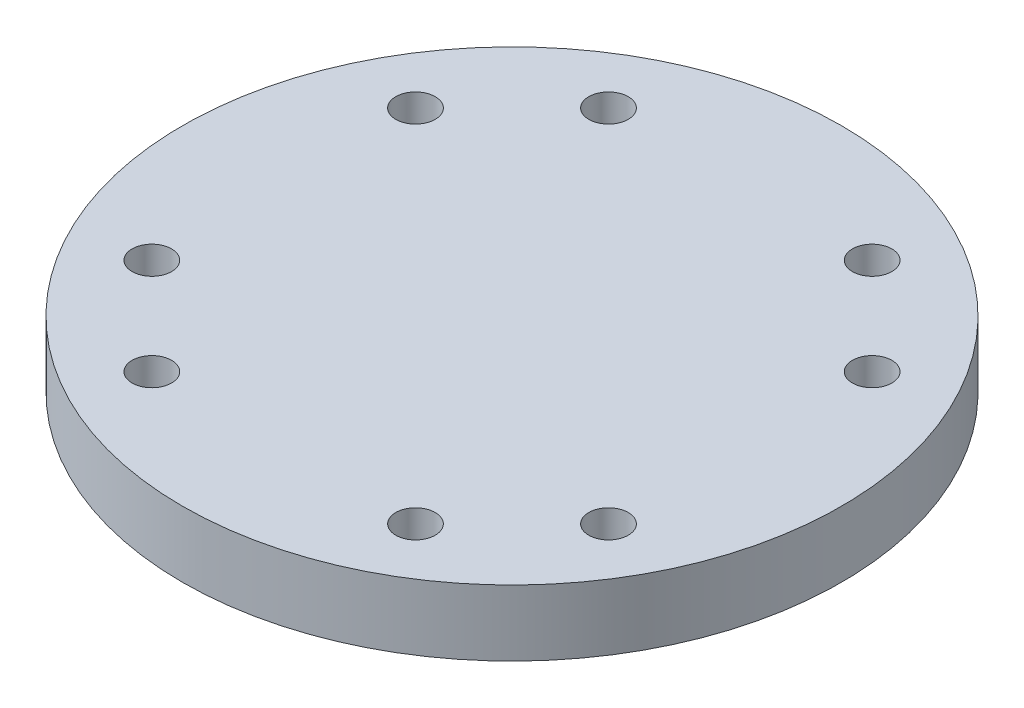
ISO-10303-21;
HEADER;
FILE_DESCRIPTION(('STEP AP214'),'2;1');
FILE_NAME('part.step','',(''),(''),'','','');
FILE_SCHEMA(('AUTOMOTIVE_DESIGN { 1 0 10303 214 1 1 1 1 }'));
ENDSEC;
DATA;
#1=APPLICATION_CONTEXT('core data for automotive mechanical design processes');
#2=APPLICATION_PROTOCOL_DEFINITION('international standard','automotive_design',2000,#1);
#3=PRODUCT_CONTEXT('',#1,'mechanical');
#4=PRODUCT('Part','Part','',(#3));
#5=PRODUCT_RELATED_PRODUCT_CATEGORY('part','',(#4));
#6=PRODUCT_DEFINITION_FORMATION('','',#4);
#7=PRODUCT_DEFINITION_CONTEXT('part definition',#1,'design');
#8=PRODUCT_DEFINITION('design','',#6,#7);
#9=PRODUCT_DEFINITION_SHAPE('','',#8);
#10=(LENGTH_UNIT() NAMED_UNIT(*) SI_UNIT(.MILLI.,.METRE.));
#11=(NAMED_UNIT(*) PLANE_ANGLE_UNIT() SI_UNIT($,.RADIAN.));
#12=(NAMED_UNIT(*) SI_UNIT($,.STERADIAN.) SOLID_ANGLE_UNIT());
#13=UNCERTAINTY_MEASURE_WITH_UNIT(LENGTH_MEASURE(1.E-05),#10,'distance_accuracy_value','');
#14=(GEOMETRIC_REPRESENTATION_CONTEXT(3) GLOBAL_UNCERTAINTY_ASSIGNED_CONTEXT((#13)) GLOBAL_UNIT_ASSIGNED_CONTEXT((#10,
#11,#12)) REPRESENTATION_CONTEXT('',''));
#15=CARTESIAN_POINT('',(0.,0.,0.));
#16=DIRECTION('',(0.,0.,1.));
#17=DIRECTION('',(1.,0.,0.));
#18=AXIS2_PLACEMENT_3D('',#15,#16,#17);
#19=CARTESIAN_POINT('',(0.,3.175,0.));
#20=DIRECTION('',(0.,1.,0.));
#21=DIRECTION('',(0.,0.,1.));
#22=AXIS2_PLACEMENT_3D('',#19,#20,#21);
#23=PLANE('',#22);
#24=CARTESIAN_POINT('',(-12.6999999999996,3.175,-21.9970452561249));
#25=DIRECTION('',(0.,1.,0.));
#26=DIRECTION('',(0.,0.,1.));
#27=AXIS2_PLACEMENT_3D('',#24,#25,#26);
#28=CIRCLE('',#27,1.90000001);
#29=CARTESIAN_POINT('',(-12.6999999999996,3.175,-20.0970452461249));
#30=VERTEX_POINT('',#29);
#31=EDGE_CURVE('E100',#30,#30,#28,.T.);
#32=ORIENTED_EDGE('',*,*,#31,.F.);
#33=EDGE_LOOP('',(#32));
#34=FACE_BOUND('',#33,.T.);
#35=CARTESIAN_POINT('',(-21.9970452561249,3.175,12.6999999999997));
#36=DIRECTION('',(0.,1.,0.));
#37=DIRECTION('',(0.,0.,1.));
#38=AXIS2_PLACEMENT_3D('',#35,#36,#37);
#39=CIRCLE('',#38,1.90000001);
#40=CARTESIAN_POINT('',(-21.9970452561249,3.175,14.6000000099997));
#41=VERTEX_POINT('',#40);
#42=EDGE_CURVE('E84',#41,#41,#39,.T.);
#43=ORIENTED_EDGE('',*,*,#42,.F.);
#44=EDGE_LOOP('',(#43));
#45=FACE_BOUND('',#44,.T.);
#46=CARTESIAN_POINT('',(12.6999999999998,3.175,21.9970452561249));
#47=DIRECTION('',(0.,1.,0.));
#48=DIRECTION('',(0.,0.,1.));
#49=AXIS2_PLACEMENT_3D('',#46,#47,#48);
#50=CIRCLE('',#49,1.90000001);
#51=CARTESIAN_POINT('',(12.6999999999998,3.175,23.8970452661249));
#52=VERTEX_POINT('',#51);
#53=EDGE_CURVE('E68',#52,#52,#50,.T.);
#54=ORIENTED_EDGE('',*,*,#53,.F.);
#55=EDGE_LOOP('',(#54));
#56=FACE_BOUND('',#55,.T.);
#57=CARTESIAN_POINT('',(21.9970452561248,3.175,-12.6999999999999));
#58=DIRECTION('',(0.,1.,0.));
#59=DIRECTION('',(0.,0.,1.));
#60=AXIS2_PLACEMENT_3D('',#57,#58,#59);
#61=CIRCLE('',#60,1.90000001);
#62=CARTESIAN_POINT('',(21.9970452561248,3.175,-10.7999999899999));
#63=VERTEX_POINT('',#62);
#64=EDGE_CURVE('E54',#63,#63,#61,.T.);
#65=ORIENTED_EDGE('',*,*,#64,.F.);
#66=EDGE_LOOP('',(#65));
#67=FACE_BOUND('',#66,.T.);
#68=CARTESIAN_POINT('',(0.,3.175,0.));
#69=DIRECTION('',(0.,1.,0.));
#70=DIRECTION('',(0.,0.,1.));
#71=AXIS2_PLACEMENT_3D('',#68,#69,#70);
#72=CIRCLE('',#71,31.75);
#73=CARTESIAN_POINT('',(0.,3.175,31.75));
#74=VERTEX_POINT('',#73);
#75=EDGE_CURVE('E10',#74,#74,#72,.T.);
#76=ORIENTED_EDGE('',*,*,#75,.T.);
#77=EDGE_LOOP('',(#76));
#78=FACE_BOUND('',#77,.T.);
#79=CARTESIAN_POINT('',(21.9970452561248,3.175,12.6999999999999));
#80=DIRECTION('',(0.,1.,0.));
#81=DIRECTION('',(0.,0.,-1.));
#82=AXIS2_PLACEMENT_3D('',#79,#80,#81);
#83=CIRCLE('',#82,1.90000001);
#84=CARTESIAN_POINT('',(21.9970452561248,3.175,10.7999999899999));
#85=VERTEX_POINT('',#84);
#86=EDGE_CURVE('E60',#85,#85,#83,.T.);
#87=ORIENTED_EDGE('',*,*,#86,.F.);
#88=EDGE_LOOP('',(#87));
#89=FACE_BOUND('',#88,.T.);
#90=CARTESIAN_POINT('',(-12.6999999999999,3.175,21.9970452561248));
#91=DIRECTION('',(0.,1.,0.));
#92=DIRECTION('',(0.,0.,-1.));
#93=AXIS2_PLACEMENT_3D('',#90,#91,#92);
#94=CIRCLE('',#93,1.90000001);
#95=CARTESIAN_POINT('',(-12.6999999999999,3.175,20.0970452461248));
#96=VERTEX_POINT('',#95);
#97=EDGE_CURVE('E76',#96,#96,#94,.T.);
#98=ORIENTED_EDGE('',*,*,#97,.F.);
#99=EDGE_LOOP('',(#98));
#100=FACE_BOUND('',#99,.T.);
#101=CARTESIAN_POINT('',(-21.9970452561247,3.175,-12.7));
#102=DIRECTION('',(0.,1.,0.));
#103=DIRECTION('',(0.,0.,-1.));
#104=AXIS2_PLACEMENT_3D('',#101,#102,#103);
#105=CIRCLE('',#104,1.90000001);
#106=CARTESIAN_POINT('',(-21.9970452561247,3.175,-14.60000001));
#107=VERTEX_POINT('',#106);
#108=EDGE_CURVE('E92',#107,#107,#105,.T.);
#109=ORIENTED_EDGE('',*,*,#108,.F.);
#110=EDGE_LOOP('',(#109));
#111=FACE_BOUND('',#110,.T.);
#112=CARTESIAN_POINT('',(12.7000000000001,3.175,-21.9970452561247));
#113=DIRECTION('',(0.,1.,0.));
#114=DIRECTION('',(0.,0.,-1.));
#115=AXIS2_PLACEMENT_3D('',#112,#113,#114);
#116=CIRCLE('',#115,1.90000001);
#117=CARTESIAN_POINT('',(12.7000000000001,3.175,-23.8970452661247));
#118=VERTEX_POINT('',#117);
#119=EDGE_CURVE('E108',#118,#118,#116,.T.);
#120=ORIENTED_EDGE('',*,*,#119,.F.);
#121=EDGE_LOOP('',(#120));
#122=FACE_BOUND('',#121,.T.);
#123=ADVANCED_FACE('F41',(#34,#45,#56,#67,#78,#89,#100,#111,#122),#23,.T.);
#124=CARTESIAN_POINT('',(0.,-3.175,0.));
#125=DIRECTION('',(0.,1.,0.));
#126=DIRECTION('',(0.,0.,1.));
#127=AXIS2_PLACEMENT_3D('',#124,#125,#126);
#128=PLANE('',#127);
#129=CARTESIAN_POINT('',(0.,-3.175,0.));
#130=DIRECTION('',(0.,1.,0.));
#131=DIRECTION('',(0.,0.,1.));
#132=AXIS2_PLACEMENT_3D('',#129,#130,#131);
#133=CIRCLE('',#132,31.75);
#134=CARTESIAN_POINT('',(0.,-3.175,31.75));
#135=VERTEX_POINT('',#134);
#136=EDGE_CURVE('E45',#135,#135,#133,.T.);
#137=ORIENTED_EDGE('',*,*,#136,.F.);
#138=EDGE_LOOP('',(#137));
#139=FACE_BOUND('',#138,.T.);
#140=CARTESIAN_POINT('',(21.9970452561248,-3.175,-12.6999999999999));
#141=DIRECTION('',(0.,1.,0.));
#142=DIRECTION('',(0.,0.,1.));
#143=AXIS2_PLACEMENT_3D('',#140,#141,#142);
#144=CIRCLE('',#143,1.90000001);
#145=CARTESIAN_POINT('',(21.9970452561248,-3.175,-10.7999999899999));
#146=VERTEX_POINT('',#145);
#147=EDGE_CURVE('E56',#146,#146,#144,.T.);
#148=ORIENTED_EDGE('',*,*,#147,.T.);
#149=EDGE_LOOP('',(#148));
#150=FACE_BOUND('',#149,.T.);
#151=CARTESIAN_POINT('',(21.9970452561248,-3.175,12.6999999999999));
#152=DIRECTION('',(0.,1.,0.));
#153=DIRECTION('',(0.,0.,-1.));
#154=AXIS2_PLACEMENT_3D('',#151,#152,#153);
#155=CIRCLE('',#154,1.90000001);
#156=CARTESIAN_POINT('',(21.9970452561248,-3.175,10.7999999899999));
#157=VERTEX_POINT('',#156);
#158=EDGE_CURVE('E64',#157,#157,#155,.T.);
#159=ORIENTED_EDGE('',*,*,#158,.T.);
#160=EDGE_LOOP('',(#159));
#161=FACE_BOUND('',#160,.T.);
#162=CARTESIAN_POINT('',(12.6999999999998,-3.175,21.9970452561249));
#163=DIRECTION('',(0.,1.,0.));
#164=DIRECTION('',(0.,0.,1.));
#165=AXIS2_PLACEMENT_3D('',#162,#163,#164);
#166=CIRCLE('',#165,1.90000001);
#167=CARTESIAN_POINT('',(12.6999999999998,-3.175,23.8970452661249));
#168=VERTEX_POINT('',#167);
#169=EDGE_CURVE('E72',#168,#168,#166,.T.);
#170=ORIENTED_EDGE('',*,*,#169,.T.);
#171=EDGE_LOOP('',(#170));
#172=FACE_BOUND('',#171,.T.);
#173=CARTESIAN_POINT('',(-12.6999999999999,-3.175,21.9970452561248));
#174=DIRECTION('',(0.,1.,0.));
#175=DIRECTION('',(0.,0.,-1.));
#176=AXIS2_PLACEMENT_3D('',#173,#174,#175);
#177=CIRCLE('',#176,1.90000001);
#178=CARTESIAN_POINT('',(-12.6999999999999,-3.175,20.0970452461248));
#179=VERTEX_POINT('',#178);
#180=EDGE_CURVE('E80',#179,#179,#177,.T.);
#181=ORIENTED_EDGE('',*,*,#180,.T.);
#182=EDGE_LOOP('',(#181));
#183=FACE_BOUND('',#182,.T.);
#184=CARTESIAN_POINT('',(-21.9970452561249,-3.175,12.6999999999997));
#185=DIRECTION('',(0.,1.,0.));
#186=DIRECTION('',(0.,0.,1.));
#187=AXIS2_PLACEMENT_3D('',#184,#185,#186);
#188=CIRCLE('',#187,1.90000001);
#189=CARTESIAN_POINT('',(-21.9970452561249,-3.175,14.6000000099997));
#190=VERTEX_POINT('',#189);
#191=EDGE_CURVE('E88',#190,#190,#188,.T.);
#192=ORIENTED_EDGE('',*,*,#191,.T.);
#193=EDGE_LOOP('',(#192));
#194=FACE_BOUND('',#193,.T.);
#195=CARTESIAN_POINT('',(-21.9970452561247,-3.175,-12.7));
#196=DIRECTION('',(0.,1.,0.));
#197=DIRECTION('',(0.,0.,-1.));
#198=AXIS2_PLACEMENT_3D('',#195,#196,#197);
#199=CIRCLE('',#198,1.90000001);
#200=CARTESIAN_POINT('',(-21.9970452561247,-3.175,-14.60000001));
#201=VERTEX_POINT('',#200);
#202=EDGE_CURVE('E96',#201,#201,#199,.T.);
#203=ORIENTED_EDGE('',*,*,#202,.T.);
#204=EDGE_LOOP('',(#203));
#205=FACE_BOUND('',#204,.T.);
#206=CARTESIAN_POINT('',(-12.6999999999996,-3.175,-21.9970452561249));
#207=DIRECTION('',(0.,1.,0.));
#208=DIRECTION('',(0.,0.,1.));
#209=AXIS2_PLACEMENT_3D('',#206,#207,#208);
#210=CIRCLE('',#209,1.90000001);
#211=CARTESIAN_POINT('',(-12.6999999999996,-3.175,-20.0970452461249));
#212=VERTEX_POINT('',#211);
#213=EDGE_CURVE('E104',#212,#212,#210,.T.);
#214=ORIENTED_EDGE('',*,*,#213,.T.);
#215=EDGE_LOOP('',(#214));
#216=FACE_BOUND('',#215,.T.);
#217=CARTESIAN_POINT('',(12.7000000000001,-3.175,-21.9970452561247));
#218=DIRECTION('',(0.,1.,0.));
#219=DIRECTION('',(0.,0.,-1.));
#220=AXIS2_PLACEMENT_3D('',#217,#218,#219);
#221=CIRCLE('',#220,1.90000001);
#222=CARTESIAN_POINT('',(12.7000000000001,-3.175,-23.8970452661247));
#223=VERTEX_POINT('',#222);
#224=EDGE_CURVE('E112',#223,#223,#221,.T.);
#225=ORIENTED_EDGE('',*,*,#224,.T.);
#226=EDGE_LOOP('',(#225));
#227=FACE_BOUND('',#226,.T.);
#228=ADVANCED_FACE('F124',(#139,#150,#161,#172,#183,#194,#205,#216,#227),#128,.F.);
#229=CARTESIAN_POINT('',(0.,3.175,0.));
#230=DIRECTION('',(0.,-1.,0.));
#231=DIRECTION('',(0.,0.,-1.));
#232=AXIS2_PLACEMENT_3D('',#229,#230,#231);
#233=CYLINDRICAL_SURFACE('',#232,31.75);
#234=ORIENTED_EDGE('',*,*,#75,.F.);
#235=EDGE_LOOP('',(#234));
#236=FACE_BOUND('',#235,.T.);
#237=ORIENTED_EDGE('',*,*,#136,.T.);
#238=EDGE_LOOP('',(#237));
#239=FACE_BOUND('',#238,.T.);
#240=ADVANCED_FACE('F43',(#236,#239),#233,.T.);
#241=CARTESIAN_POINT('',(21.9970452561248,3.175,-12.6999999999999));
#242=DIRECTION('',(0.,-1.,0.));
#243=DIRECTION('',(0.,0.,-1.));
#244=AXIS2_PLACEMENT_3D('',#241,#242,#243);
#245=CYLINDRICAL_SURFACE('',#244,1.90000001);
#246=ORIENTED_EDGE('',*,*,#64,.T.);
#247=EDGE_LOOP('',(#246));
#248=FACE_BOUND('',#247,.T.);
#249=ORIENTED_EDGE('',*,*,#147,.F.);
#250=EDGE_LOOP('',(#249));
#251=FACE_BOUND('',#250,.T.);
#252=ADVANCED_FACE('F134',(#248,#251),#245,.F.);
#253=CARTESIAN_POINT('',(21.9970452561248,3.175,12.6999999999999));
#254=DIRECTION('',(0.,-1.,0.));
#255=DIRECTION('',(0.,0.,-1.));
#256=AXIS2_PLACEMENT_3D('',#253,#254,#255);
#257=CYLINDRICAL_SURFACE('',#256,1.90000001);
#258=ORIENTED_EDGE('',*,*,#86,.T.);
#259=EDGE_LOOP('',(#258));
#260=FACE_BOUND('',#259,.T.);
#261=ORIENTED_EDGE('',*,*,#158,.F.);
#262=EDGE_LOOP('',(#261));
#263=FACE_BOUND('',#262,.T.);
#264=ADVANCED_FACE('F137',(#260,#263),#257,.F.);
#265=CARTESIAN_POINT('',(12.6999999999998,3.175,21.9970452561249));
#266=DIRECTION('',(0.,-1.,0.));
#267=DIRECTION('',(0.,0.,-1.));
#268=AXIS2_PLACEMENT_3D('',#265,#266,#267);
#269=CYLINDRICAL_SURFACE('',#268,1.90000001);
#270=ORIENTED_EDGE('',*,*,#53,.T.);
#271=EDGE_LOOP('',(#270));
#272=FACE_BOUND('',#271,.T.);
#273=ORIENTED_EDGE('',*,*,#169,.F.);
#274=EDGE_LOOP('',(#273));
#275=FACE_BOUND('',#274,.T.);
#276=ADVANCED_FACE('F141',(#272,#275),#269,.F.);
#277=CARTESIAN_POINT('',(-12.6999999999999,3.175,21.9970452561248));
#278=DIRECTION('',(0.,-1.,0.));
#279=DIRECTION('',(0.,0.,-1.));
#280=AXIS2_PLACEMENT_3D('',#277,#278,#279);
#281=CYLINDRICAL_SURFACE('',#280,1.90000001);
#282=ORIENTED_EDGE('',*,*,#97,.T.);
#283=EDGE_LOOP('',(#282));
#284=FACE_BOUND('',#283,.T.);
#285=ORIENTED_EDGE('',*,*,#180,.F.);
#286=EDGE_LOOP('',(#285));
#287=FACE_BOUND('',#286,.T.);
#288=ADVANCED_FACE('F145',(#284,#287),#281,.F.);
#289=CARTESIAN_POINT('',(-21.9970452561249,3.175,12.6999999999997));
#290=DIRECTION('',(0.,-1.,0.));
#291=DIRECTION('',(0.,0.,-1.));
#292=AXIS2_PLACEMENT_3D('',#289,#290,#291);
#293=CYLINDRICAL_SURFACE('',#292,1.90000001);
#294=ORIENTED_EDGE('',*,*,#42,.T.);
#295=EDGE_LOOP('',(#294));
#296=FACE_BOUND('',#295,.T.);
#297=ORIENTED_EDGE('',*,*,#191,.F.);
#298=EDGE_LOOP('',(#297));
#299=FACE_BOUND('',#298,.T.);
#300=ADVANCED_FACE('F149',(#296,#299),#293,.F.);
#301=CARTESIAN_POINT('',(-21.9970452561247,3.175,-12.7));
#302=DIRECTION('',(0.,-1.,0.));
#303=DIRECTION('',(0.,0.,-1.));
#304=AXIS2_PLACEMENT_3D('',#301,#302,#303);
#305=CYLINDRICAL_SURFACE('',#304,1.90000001);
#306=ORIENTED_EDGE('',*,*,#108,.T.);
#307=EDGE_LOOP('',(#306));
#308=FACE_BOUND('',#307,.T.);
#309=ORIENTED_EDGE('',*,*,#202,.F.);
#310=EDGE_LOOP('',(#309));
#311=FACE_BOUND('',#310,.T.);
#312=ADVANCED_FACE('F153',(#308,#311),#305,.F.);
#313=CARTESIAN_POINT('',(-12.6999999999996,3.175,-21.9970452561249));
#314=DIRECTION('',(0.,-1.,0.));
#315=DIRECTION('',(0.,0.,-1.));
#316=AXIS2_PLACEMENT_3D('',#313,#314,#315);
#317=CYLINDRICAL_SURFACE('',#316,1.90000001);
#318=ORIENTED_EDGE('',*,*,#31,.T.);
#319=EDGE_LOOP('',(#318));
#320=FACE_BOUND('',#319,.T.);
#321=ORIENTED_EDGE('',*,*,#213,.F.);
#322=EDGE_LOOP('',(#321));
#323=FACE_BOUND('',#322,.T.);
#324=ADVANCED_FACE('F157',(#320,#323),#317,.F.);
#325=CARTESIAN_POINT('',(12.7000000000001,3.175,-21.9970452561247));
#326=DIRECTION('',(0.,-1.,0.));
#327=DIRECTION('',(0.,0.,-1.));
#328=AXIS2_PLACEMENT_3D('',#325,#326,#327);
#329=CYLINDRICAL_SURFACE('',#328,1.90000001);
#330=ORIENTED_EDGE('',*,*,#119,.T.);
#331=EDGE_LOOP('',(#330));
#332=FACE_BOUND('',#331,.T.);
#333=ORIENTED_EDGE('',*,*,#224,.F.);
#334=EDGE_LOOP('',(#333));
#335=FACE_BOUND('',#334,.T.);
#336=ADVANCED_FACE('F120',(#332,#335),#329,.F.);
#337=CLOSED_SHELL('',(#123,#228,#240,#252,#264,#276,#288,#300,#312,#324,#336));
#338=MANIFOLD_SOLID_BREP('B2',#337);
#339=ADVANCED_BREP_SHAPE_REPRESENTATION('',(#18,#338),#14);
#340=SHAPE_DEFINITION_REPRESENTATION(#9,#339);
ENDSEC;
END-ISO-10303-21;
